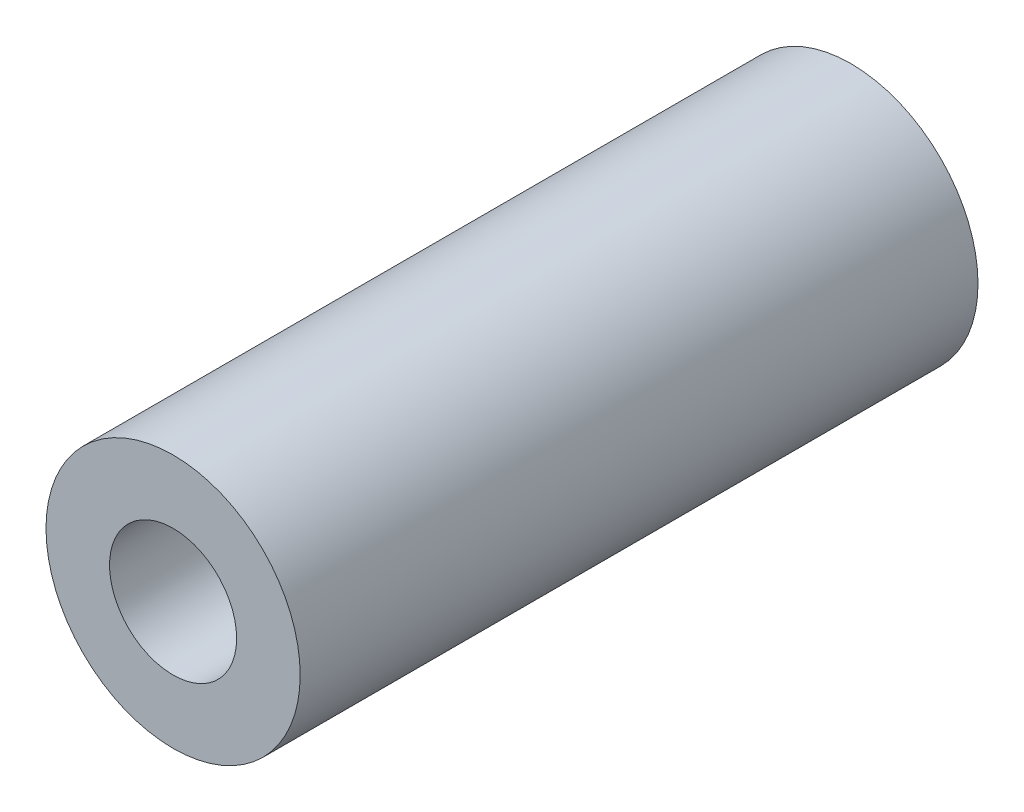
ISO-10303-21;
HEADER;
FILE_DESCRIPTION(('STEP AP214'),'2;1');
FILE_NAME('part.step','',(''),(''),'','','');
FILE_SCHEMA(('AUTOMOTIVE_DESIGN { 1 0 10303 214 1 1 1 1 }'));
ENDSEC;
DATA;
#1=APPLICATION_CONTEXT('core data for automotive mechanical design processes');
#2=APPLICATION_PROTOCOL_DEFINITION('international standard','automotive_design',2000,#1);
#3=PRODUCT_CONTEXT('',#1,'mechanical');
#4=PRODUCT('Part','Part','',(#3));
#5=PRODUCT_RELATED_PRODUCT_CATEGORY('part','',(#4));
#6=PRODUCT_DEFINITION_FORMATION('','',#4);
#7=PRODUCT_DEFINITION_CONTEXT('part definition',#1,'design');
#8=PRODUCT_DEFINITION('design','',#6,#7);
#9=PRODUCT_DEFINITION_SHAPE('','',#8);
#10=(LENGTH_UNIT() NAMED_UNIT(*) SI_UNIT(.MILLI.,.METRE.));
#11=(NAMED_UNIT(*) PLANE_ANGLE_UNIT() SI_UNIT($,.RADIAN.));
#12=(NAMED_UNIT(*) SI_UNIT($,.STERADIAN.) SOLID_ANGLE_UNIT());
#13=UNCERTAINTY_MEASURE_WITH_UNIT(LENGTH_MEASURE(1.E-05),#10,'distance_accuracy_value','');
#14=(GEOMETRIC_REPRESENTATION_CONTEXT(3) GLOBAL_UNCERTAINTY_ASSIGNED_CONTEXT((#13)) GLOBAL_UNIT_ASSIGNED_CONTEXT((#10,
#11,#12)) REPRESENTATION_CONTEXT('',''));
#15=CARTESIAN_POINT('',(0.,0.,0.));
#16=DIRECTION('',(0.,0.,1.));
#17=DIRECTION('',(1.,0.,0.));
#18=AXIS2_PLACEMENT_3D('',#15,#16,#17);
#19=CARTESIAN_POINT('',(0.,0.,16.));
#20=DIRECTION('',(0.,0.,1.));
#21=DIRECTION('',(1.,0.,0.));
#22=AXIS2_PLACEMENT_3D('',#19,#20,#21);
#23=PLANE('',#22);
#24=CARTESIAN_POINT('',(0.,0.,16.));
#25=DIRECTION('',(0.,0.,1.));
#26=DIRECTION('',(1.,0.,0.));
#27=AXIS2_PLACEMENT_3D('',#24,#25,#26);
#28=CIRCLE('',#27,3.);
#29=CARTESIAN_POINT('',(3.,0.,16.));
#30=VERTEX_POINT('',#29);
#31=EDGE_CURVE('E10',#30,#30,#28,.T.);
#32=ORIENTED_EDGE('',*,*,#31,.T.);
#33=EDGE_LOOP('',(#32));
#34=FACE_BOUND('',#33,.T.);
#35=CARTESIAN_POINT('',(0.,0.,16.));
#36=DIRECTION('',(0.,0.,1.));
#37=DIRECTION('',(1.,0.,0.));
#38=AXIS2_PLACEMENT_3D('',#35,#36,#37);
#39=CIRCLE('',#38,1.5);
#40=CARTESIAN_POINT('',(1.5,0.,16.));
#41=VERTEX_POINT('',#40);
#42=EDGE_CURVE('E41',#41,#41,#39,.T.);
#43=ORIENTED_EDGE('',*,*,#42,.F.);
#44=EDGE_LOOP('',(#43));
#45=FACE_BOUND('',#44,.T.);
#46=ADVANCED_FACE('F30',(#34,#45),#23,.T.);
#47=CARTESIAN_POINT('',(0.,0.,0.));
#48=DIRECTION('',(0.,0.,1.));
#49=DIRECTION('',(1.,0.,0.));
#50=AXIS2_PLACEMENT_3D('',#47,#48,#49);
#51=PLANE('',#50);
#52=CARTESIAN_POINT('',(0.,0.,0.));
#53=DIRECTION('',(0.,0.,1.));
#54=DIRECTION('',(1.,0.,0.));
#55=AXIS2_PLACEMENT_3D('',#52,#53,#54);
#56=CIRCLE('',#55,3.);
#57=CARTESIAN_POINT('',(3.,0.,0.));
#58=VERTEX_POINT('',#57);
#59=EDGE_CURVE('E34',#58,#58,#56,.T.);
#60=ORIENTED_EDGE('',*,*,#59,.F.);
#61=EDGE_LOOP('',(#60));
#62=FACE_BOUND('',#61,.T.);
#63=CARTESIAN_POINT('',(0.,0.,0.));
#64=DIRECTION('',(0.,0.,1.));
#65=DIRECTION('',(1.,0.,0.));
#66=AXIS2_PLACEMENT_3D('',#63,#64,#65);
#67=CIRCLE('',#66,1.5);
#68=CARTESIAN_POINT('',(1.5,0.,0.));
#69=VERTEX_POINT('',#68);
#70=EDGE_CURVE('E43',#69,#69,#67,.T.);
#71=ORIENTED_EDGE('',*,*,#70,.T.);
#72=EDGE_LOOP('',(#71));
#73=FACE_BOUND('',#72,.T.);
#74=ADVANCED_FACE('F53',(#62,#73),#51,.F.);
#75=CARTESIAN_POINT('',(0.,0.,16.));
#76=DIRECTION('',(0.,0.,-1.));
#77=DIRECTION('',(-1.,0.,0.));
#78=AXIS2_PLACEMENT_3D('',#75,#76,#77);
#79=CYLINDRICAL_SURFACE('',#78,3.);
#80=ORIENTED_EDGE('',*,*,#31,.F.);
#81=EDGE_LOOP('',(#80));
#82=FACE_BOUND('',#81,.T.);
#83=ORIENTED_EDGE('',*,*,#59,.T.);
#84=EDGE_LOOP('',(#83));
#85=FACE_BOUND('',#84,.T.);
#86=ADVANCED_FACE('F32',(#82,#85),#79,.T.);
#87=CARTESIAN_POINT('',(0.,0.,16.));
#88=DIRECTION('',(0.,0.,-1.));
#89=DIRECTION('',(-1.,0.,0.));
#90=AXIS2_PLACEMENT_3D('',#87,#88,#89);
#91=CYLINDRICAL_SURFACE('',#90,1.5);
#92=ORIENTED_EDGE('',*,*,#42,.T.);
#93=EDGE_LOOP('',(#92));
#94=FACE_BOUND('',#93,.T.);
#95=ORIENTED_EDGE('',*,*,#70,.F.);
#96=EDGE_LOOP('',(#95));
#97=FACE_BOUND('',#96,.T.);
#98=ADVANCED_FACE('F49',(#94,#97),#91,.F.);
#99=CLOSED_SHELL('',(#46,#74,#86,#98));
#100=MANIFOLD_SOLID_BREP('B2',#99);
#101=ADVANCED_BREP_SHAPE_REPRESENTATION('',(#18,#100),#14);
#102=SHAPE_DEFINITION_REPRESENTATION(#9,#101);
ENDSEC;
END-ISO-10303-21;
